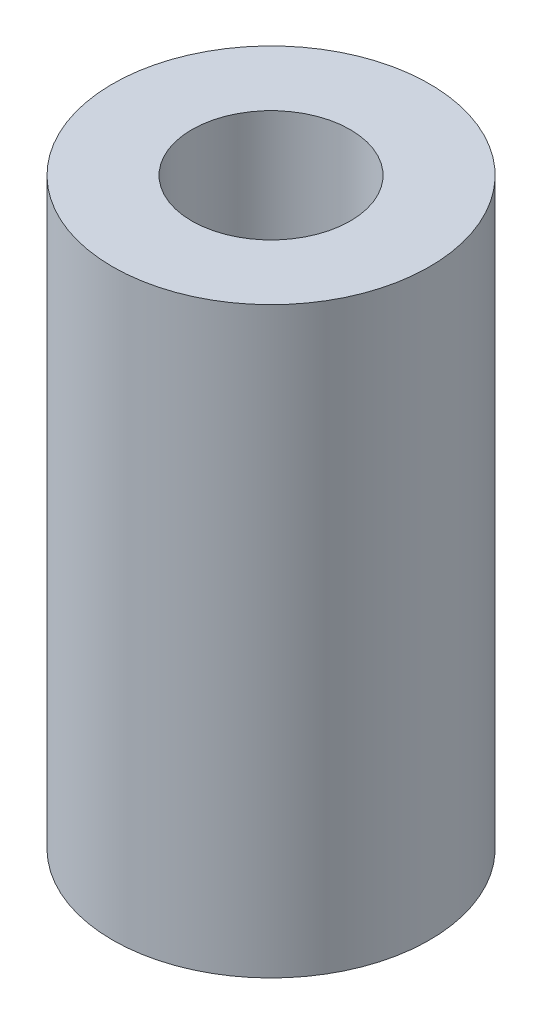
ISO-10303-21;
HEADER;
FILE_DESCRIPTION(('STEP AP214'),'2;1');
FILE_NAME('part.step','',(''),(''),'','','');
FILE_SCHEMA(('AUTOMOTIVE_DESIGN { 1 0 10303 214 1 1 1 1 }'));
ENDSEC;
DATA;
#1=APPLICATION_CONTEXT('core data for automotive mechanical design processes');
#2=APPLICATION_PROTOCOL_DEFINITION('international standard','automotive_design',2000,#1);
#3=PRODUCT_CONTEXT('',#1,'mechanical');
#4=PRODUCT('Part','Part','',(#3));
#5=PRODUCT_RELATED_PRODUCT_CATEGORY('part','',(#4));
#6=PRODUCT_DEFINITION_FORMATION('','',#4);
#7=PRODUCT_DEFINITION_CONTEXT('part definition',#1,'design');
#8=PRODUCT_DEFINITION('design','',#6,#7);
#9=PRODUCT_DEFINITION_SHAPE('','',#8);
#10=(LENGTH_UNIT() NAMED_UNIT(*) SI_UNIT(.MILLI.,.METRE.));
#11=(NAMED_UNIT(*) PLANE_ANGLE_UNIT() SI_UNIT($,.RADIAN.));
#12=(NAMED_UNIT(*) SI_UNIT($,.STERADIAN.) SOLID_ANGLE_UNIT());
#13=UNCERTAINTY_MEASURE_WITH_UNIT(LENGTH_MEASURE(1.E-05),#10,'distance_accuracy_value','');
#14=(GEOMETRIC_REPRESENTATION_CONTEXT(3) GLOBAL_UNCERTAINTY_ASSIGNED_CONTEXT((#13)) GLOBAL_UNIT_ASSIGNED_CONTEXT((#10,
#11,#12)) REPRESENTATION_CONTEXT('',''));
#15=CARTESIAN_POINT('',(0.,0.,0.));
#16=DIRECTION('',(0.,0.,1.));
#17=DIRECTION('',(1.,0.,0.));
#18=AXIS2_PLACEMENT_3D('',#15,#16,#17);
#19=CARTESIAN_POINT('',(0.,23.368,0.));
#20=DIRECTION('',(0.,1.,0.));
#21=DIRECTION('',(0.,0.,1.));
#22=AXIS2_PLACEMENT_3D('',#19,#20,#21);
#23=PLANE('',#22);
#24=CARTESIAN_POINT('',(0.,23.368,0.));
#25=DIRECTION('',(0.,1.,0.));
#26=DIRECTION('',(0.,0.,1.));
#27=AXIS2_PLACEMENT_3D('',#24,#25,#26);
#28=CIRCLE('',#27,6.35);
#29=CARTESIAN_POINT('',(0.,23.368,6.35));
#30=VERTEX_POINT('',#29);
#31=EDGE_CURVE('E10',#30,#30,#28,.T.);
#32=ORIENTED_EDGE('',*,*,#31,.T.);
#33=EDGE_LOOP('',(#32));
#34=FACE_BOUND('',#33,.T.);
#35=CARTESIAN_POINT('',(0.,23.368,0.));
#36=DIRECTION('',(0.,1.,0.));
#37=DIRECTION('',(0.,0.,1.));
#38=AXIS2_PLACEMENT_3D('',#35,#36,#37);
#39=CIRCLE('',#38,3.175);
#40=CARTESIAN_POINT('',(0.,23.368,3.175));
#41=VERTEX_POINT('',#40);
#42=EDGE_CURVE('E44',#41,#41,#39,.T.);
#43=ORIENTED_EDGE('',*,*,#42,.F.);
#44=EDGE_LOOP('',(#43));
#45=FACE_BOUND('',#44,.T.);
#46=ADVANCED_FACE('F33',(#34,#45),#23,.T.);
#47=CARTESIAN_POINT('',(0.,0.,0.));
#48=DIRECTION('',(0.,1.,0.));
#49=DIRECTION('',(0.,0.,1.));
#50=AXIS2_PLACEMENT_3D('',#47,#48,#49);
#51=PLANE('',#50);
#52=CARTESIAN_POINT('',(0.,0.,0.));
#53=DIRECTION('',(0.,1.,0.));
#54=DIRECTION('',(0.,0.,1.));
#55=AXIS2_PLACEMENT_3D('',#52,#53,#54);
#56=CIRCLE('',#55,6.35);
#57=CARTESIAN_POINT('',(0.,0.,6.35));
#58=VERTEX_POINT('',#57);
#59=EDGE_CURVE('E37',#58,#58,#56,.T.);
#60=ORIENTED_EDGE('',*,*,#59,.F.);
#61=EDGE_LOOP('',(#60));
#62=FACE_BOUND('',#61,.T.);
#63=CARTESIAN_POINT('',(0.,0.,0.));
#64=DIRECTION('',(0.,1.,0.));
#65=DIRECTION('',(0.,0.,1.));
#66=AXIS2_PLACEMENT_3D('',#63,#64,#65);
#67=CIRCLE('',#66,3.175);
#68=CARTESIAN_POINT('',(0.,0.,3.175));
#69=VERTEX_POINT('',#68);
#70=EDGE_CURVE('E46',#69,#69,#67,.T.);
#71=ORIENTED_EDGE('',*,*,#70,.T.);
#72=EDGE_LOOP('',(#71));
#73=FACE_BOUND('',#72,.T.);
#74=ADVANCED_FACE('F56',(#62,#73),#51,.F.);
#75=CARTESIAN_POINT('',(0.,23.368,0.));
#76=DIRECTION('',(0.,-1.,0.));
#77=DIRECTION('',(0.,0.,-1.));
#78=AXIS2_PLACEMENT_3D('',#75,#76,#77);
#79=CYLINDRICAL_SURFACE('',#78,6.35);
#80=ORIENTED_EDGE('',*,*,#31,.F.);
#81=EDGE_LOOP('',(#80));
#82=FACE_BOUND('',#81,.T.);
#83=ORIENTED_EDGE('',*,*,#59,.T.);
#84=EDGE_LOOP('',(#83));
#85=FACE_BOUND('',#84,.T.);
#86=ADVANCED_FACE('F35',(#82,#85),#79,.T.);
#87=CARTESIAN_POINT('',(0.,23.368,0.));
#88=DIRECTION('',(0.,-1.,0.));
#89=DIRECTION('',(0.,0.,-1.));
#90=AXIS2_PLACEMENT_3D('',#87,#88,#89);
#91=CYLINDRICAL_SURFACE('',#90,3.175);
#92=ORIENTED_EDGE('',*,*,#42,.T.);
#93=EDGE_LOOP('',(#92));
#94=FACE_BOUND('',#93,.T.);
#95=ORIENTED_EDGE('',*,*,#70,.F.);
#96=EDGE_LOOP('',(#95));
#97=FACE_BOUND('',#96,.T.);
#98=ADVANCED_FACE('F52',(#94,#97),#91,.F.);
#99=CLOSED_SHELL('',(#46,#74,#86,#98));
#100=MANIFOLD_SOLID_BREP('B2',#99);
#101=ADVANCED_BREP_SHAPE_REPRESENTATION('',(#18,#100),#14);
#102=SHAPE_DEFINITION_REPRESENTATION(#9,#101);
ENDSEC;
END-ISO-10303-21;
